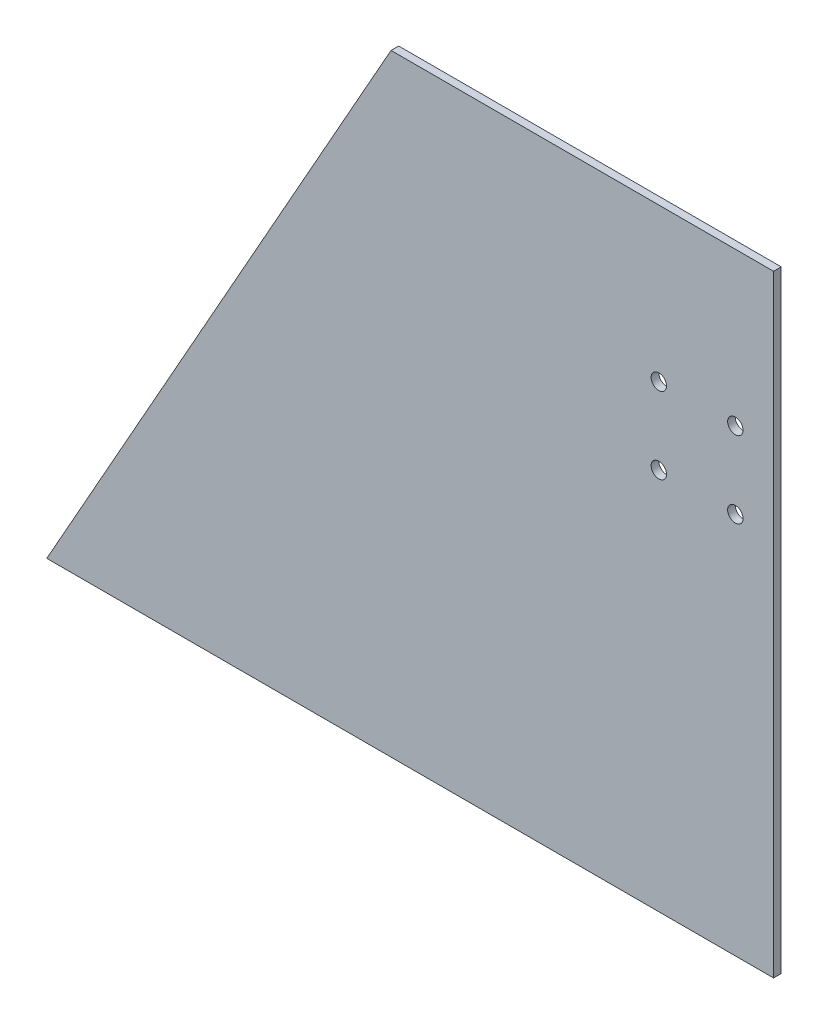
ISO-10303-21;
HEADER;
FILE_DESCRIPTION(('STEP AP214'),'2;1');
FILE_NAME('part.step','',(''),(''),'','','');
FILE_SCHEMA(('AUTOMOTIVE_DESIGN { 1 0 10303 214 1 1 1 1 }'));
ENDSEC;
DATA;
#1=APPLICATION_CONTEXT('core data for automotive mechanical design processes');
#2=APPLICATION_PROTOCOL_DEFINITION('international standard','automotive_design',2000,#1);
#3=PRODUCT_CONTEXT('',#1,'mechanical');
#4=PRODUCT('Part','Part','',(#3));
#5=PRODUCT_RELATED_PRODUCT_CATEGORY('part','',(#4));
#6=PRODUCT_DEFINITION_FORMATION('','',#4);
#7=PRODUCT_DEFINITION_CONTEXT('part definition',#1,'design');
#8=PRODUCT_DEFINITION('design','',#6,#7);
#9=PRODUCT_DEFINITION_SHAPE('','',#8);
#10=(LENGTH_UNIT() NAMED_UNIT(*) SI_UNIT(.MILLI.,.METRE.));
#11=(NAMED_UNIT(*) PLANE_ANGLE_UNIT() SI_UNIT($,.RADIAN.));
#12=(NAMED_UNIT(*) SI_UNIT($,.STERADIAN.) SOLID_ANGLE_UNIT());
#13=UNCERTAINTY_MEASURE_WITH_UNIT(LENGTH_MEASURE(1.E-05),#10,'distance_accuracy_value','');
#14=(GEOMETRIC_REPRESENTATION_CONTEXT(3) GLOBAL_UNCERTAINTY_ASSIGNED_CONTEXT((#13)) GLOBAL_UNIT_ASSIGNED_CONTEXT((#10,
#11,#12)) REPRESENTATION_CONTEXT('',''));
#15=CARTESIAN_POINT('',(0.,0.,0.));
#16=DIRECTION('',(0.,0.,1.));
#17=DIRECTION('',(1.,0.,0.));
#18=AXIS2_PLACEMENT_3D('',#15,#16,#17);
#19=CARTESIAN_POINT('',(114.3,203.2,2.54));
#20=DIRECTION('',(0.871575537124549,-0.490261239632559,0.));
#21=DIRECTION('',(0.490261239632559,0.871575537124549,0.));
#22=AXIS2_PLACEMENT_3D('',#19,#20,#21);
#23=PLANE('',#22);
#24=DIRECTION('',(-0.490261239632559,-0.871575537124549,0.));
#25=VECTOR('',#24,1.);
#26=CARTESIAN_POINT('',(114.3,203.2,0.));
#27=LINE('',#26,#25);
#28=CARTESIAN_POINT('',(114.3,203.2,0.));
#29=VERTEX_POINT('',#28);
#30=CARTESIAN_POINT('',(0.,0.,0.));
#31=VERTEX_POINT('',#30);
#32=EDGE_CURVE('E98',#29,#31,#27,.T.);
#33=ORIENTED_EDGE('',*,*,#32,.T.);
#34=DIRECTION('',(0.,0.,-1.));
#35=VECTOR('',#34,1.);
#36=CARTESIAN_POINT('',(0.,0.,2.54));
#37=LINE('',#36,#35);
#38=CARTESIAN_POINT('',(0.,0.,2.54));
#39=VERTEX_POINT('',#38);
#40=EDGE_CURVE('E11',#39,#31,#37,.T.);
#41=ORIENTED_EDGE('',*,*,#40,.F.);
#42=DIRECTION('',(-0.490261239632559,-0.871575537124549,0.));
#43=VECTOR('',#42,1.);
#44=CARTESIAN_POINT('',(114.3,203.2,2.54));
#45=LINE('',#44,#43);
#46=CARTESIAN_POINT('',(114.3,203.2,2.54));
#47=VERTEX_POINT('',#46);
#48=EDGE_CURVE('E86',#47,#39,#45,.T.);
#49=ORIENTED_EDGE('',*,*,#48,.F.);
#50=DIRECTION('',(0.,0.,-1.));
#51=VECTOR('',#50,1.);
#52=CARTESIAN_POINT('',(114.3,203.2,2.54));
#53=LINE('',#52,#51);
#54=EDGE_CURVE('E94',#47,#29,#53,.T.);
#55=ORIENTED_EDGE('',*,*,#54,.T.);
#56=EDGE_LOOP('',(#33,#41,#49,#55));
#57=FACE_BOUND('',#56,.T.);
#58=ADVANCED_FACE('F35',(#57),#23,.F.);
#59=CARTESIAN_POINT('',(0.,0.,2.54));
#60=DIRECTION('',(0.,1.,0.));
#61=DIRECTION('',(0.,0.,1.));
#62=AXIS2_PLACEMENT_3D('',#59,#60,#61);
#63=PLANE('',#62);
#64=DIRECTION('',(1.,0.,0.));
#65=VECTOR('',#64,1.);
#66=CARTESIAN_POINT('',(0.,0.,0.));
#67=LINE('',#66,#65);
#68=CARTESIAN_POINT('',(241.3,0.,0.));
#69=VERTEX_POINT('',#68);
#70=EDGE_CURVE('E90',#31,#69,#67,.T.);
#71=ORIENTED_EDGE('',*,*,#70,.T.);
#72=DIRECTION('',(0.,0.,-1.));
#73=VECTOR('',#72,1.);
#74=CARTESIAN_POINT('',(241.3,0.,2.54));
#75=LINE('',#74,#73);
#76=CARTESIAN_POINT('',(241.3,0.,2.54));
#77=VERTEX_POINT('',#76);
#78=EDGE_CURVE('E43',#77,#69,#75,.T.);
#79=ORIENTED_EDGE('',*,*,#78,.F.);
#80=DIRECTION('',(1.,0.,0.));
#81=VECTOR('',#80,1.);
#82=CARTESIAN_POINT('',(0.,0.,2.54));
#83=LINE('',#82,#81);
#84=EDGE_CURVE('E81',#39,#77,#83,.T.);
#85=ORIENTED_EDGE('',*,*,#84,.F.);
#86=ORIENTED_EDGE('',*,*,#40,.T.);
#87=EDGE_LOOP('',(#71,#79,#85,#86));
#88=FACE_BOUND('',#87,.T.);
#89=ADVANCED_FACE('F89',(#88),#63,.F.);
#90=CARTESIAN_POINT('',(241.3,0.,2.54));
#91=DIRECTION('',(-1.,0.,0.));
#92=DIRECTION('',(0.,0.,1.));
#93=AXIS2_PLACEMENT_3D('',#90,#91,#92);
#94=PLANE('',#93);
#95=DIRECTION('',(0.,1.,0.));
#96=VECTOR('',#95,1.);
#97=CARTESIAN_POINT('',(241.3,0.,0.));
#98=LINE('',#97,#96);
#99=CARTESIAN_POINT('',(241.3,203.2,0.));
#100=VERTEX_POINT('',#99);
#101=EDGE_CURVE('E68',#69,#100,#98,.T.);
#102=ORIENTED_EDGE('',*,*,#101,.T.);
#103=DIRECTION('',(0.,0.,-1.));
#104=VECTOR('',#103,1.);
#105=CARTESIAN_POINT('',(241.3,203.2,2.54));
#106=LINE('',#105,#104);
#107=CARTESIAN_POINT('',(241.3,203.2,2.54));
#108=VERTEX_POINT('',#107);
#109=EDGE_CURVE('E91',#108,#100,#106,.T.);
#110=ORIENTED_EDGE('',*,*,#109,.F.);
#111=DIRECTION('',(0.,1.,0.));
#112=VECTOR('',#111,1.);
#113=CARTESIAN_POINT('',(241.3,0.,2.54));
#114=LINE('',#113,#112);
#115=EDGE_CURVE('E84',#77,#108,#114,.T.);
#116=ORIENTED_EDGE('',*,*,#115,.F.);
#117=ORIENTED_EDGE('',*,*,#78,.T.);
#118=EDGE_LOOP('',(#102,#110,#116,#117));
#119=FACE_BOUND('',#118,.T.);
#120=ADVANCED_FACE('F92',(#119),#94,.F.);
#121=CARTESIAN_POINT('',(241.3,203.2,2.54));
#122=DIRECTION('',(0.,-1.,0.));
#123=DIRECTION('',(1.,0.,0.));
#124=AXIS2_PLACEMENT_3D('',#121,#122,#123);
#125=PLANE('',#124);
#126=DIRECTION('',(-1.,0.,0.));
#127=VECTOR('',#126,1.);
#128=CARTESIAN_POINT('',(241.3,203.2,0.));
#129=LINE('',#128,#127);
#130=EDGE_CURVE('E74',#100,#29,#129,.T.);
#131=ORIENTED_EDGE('',*,*,#130,.T.);
#132=ORIENTED_EDGE('',*,*,#54,.F.);
#133=DIRECTION('',(-1.,0.,0.));
#134=VECTOR('',#133,1.);
#135=CARTESIAN_POINT('',(241.3,203.2,2.54));
#136=LINE('',#135,#134);
#137=EDGE_CURVE('E51',#108,#47,#136,.T.);
#138=ORIENTED_EDGE('',*,*,#137,.F.);
#139=ORIENTED_EDGE('',*,*,#109,.T.);
#140=EDGE_LOOP('',(#131,#132,#138,#139));
#141=FACE_BOUND('',#140,.T.);
#142=ADVANCED_FACE('F106',(#141),#125,.F.);
#143=CARTESIAN_POINT('',(0.,0.,2.54));
#144=DIRECTION('',(0.,0.,1.));
#145=DIRECTION('',(1.,0.,0.));
#146=AXIS2_PLACEMENT_3D('',#143,#144,#145);
#147=PLANE('',#146);
#148=CARTESIAN_POINT('',(203.2,152.4,2.54));
#149=DIRECTION('',(0.,0.,1.));
#150=DIRECTION('',(1.,0.,0.));
#151=AXIS2_PLACEMENT_3D('',#148,#149,#150);
#152=CIRCLE('',#151,2.55269999999999);
#153=CARTESIAN_POINT('',(205.7527,152.4,2.54));
#154=VERTEX_POINT('',#153);
#155=EDGE_CURVE('E132',#154,#154,#152,.T.);
#156=ORIENTED_EDGE('',*,*,#155,.F.);
#157=EDGE_LOOP('',(#156));
#158=FACE_BOUND('',#157,.T.);
#159=CARTESIAN_POINT('',(228.6,127.,2.54));
#160=DIRECTION('',(0.,0.,1.));
#161=DIRECTION('',(1.,0.,0.));
#162=AXIS2_PLACEMENT_3D('',#159,#160,#161);
#163=CIRCLE('',#162,2.55269999999999);
#164=CARTESIAN_POINT('',(231.1527,127.,2.54));
#165=VERTEX_POINT('',#164);
#166=EDGE_CURVE('E126',#165,#165,#163,.T.);
#167=ORIENTED_EDGE('',*,*,#166,.F.);
#168=EDGE_LOOP('',(#167));
#169=FACE_BOUND('',#168,.T.);
#170=CARTESIAN_POINT('',(203.2,127.,2.54));
#171=DIRECTION('',(0.,0.,1.));
#172=DIRECTION('',(1.,0.,0.));
#173=AXIS2_PLACEMENT_3D('',#170,#171,#172);
#174=CIRCLE('',#173,2.55269999999999);
#175=CARTESIAN_POINT('',(205.7527,127.,2.54));
#176=VERTEX_POINT('',#175);
#177=EDGE_CURVE('E120',#176,#176,#174,.T.);
#178=ORIENTED_EDGE('',*,*,#177,.F.);
#179=EDGE_LOOP('',(#178));
#180=FACE_BOUND('',#179,.T.);
#181=CARTESIAN_POINT('',(228.6,152.4,2.54));
#182=DIRECTION('',(0.,0.,1.));
#183=DIRECTION('',(1.,0.,0.));
#184=AXIS2_PLACEMENT_3D('',#181,#182,#183);
#185=CIRCLE('',#184,2.55269999999999);
#186=CARTESIAN_POINT('',(231.1527,152.4,2.54));
#187=VERTEX_POINT('',#186);
#188=EDGE_CURVE('E114',#187,#187,#185,.T.);
#189=ORIENTED_EDGE('',*,*,#188,.F.);
#190=EDGE_LOOP('',(#189));
#191=FACE_BOUND('',#190,.T.);
#192=ORIENTED_EDGE('',*,*,#48,.T.);
#193=ORIENTED_EDGE('',*,*,#84,.T.);
#194=ORIENTED_EDGE('',*,*,#115,.T.);
#195=ORIENTED_EDGE('',*,*,#137,.T.);
#196=EDGE_LOOP('',(#192,#193,#194,#195));
#197=FACE_BOUND('',#196,.T.);
#198=ADVANCED_FACE('F82',(#158,#169,#180,#191,#197),#147,.T.);
#199=CARTESIAN_POINT('',(0.,0.,0.));
#200=DIRECTION('',(0.,0.,1.));
#201=DIRECTION('',(1.,0.,0.));
#202=AXIS2_PLACEMENT_3D('',#199,#200,#201);
#203=PLANE('',#202);
#204=CARTESIAN_POINT('',(203.2,152.4,0.));
#205=DIRECTION('',(0.,0.,1.));
#206=DIRECTION('',(1.,0.,0.));
#207=AXIS2_PLACEMENT_3D('',#204,#205,#206);
#208=CIRCLE('',#207,2.55269999999999);
#209=CARTESIAN_POINT('',(205.7527,152.4,0.));
#210=VERTEX_POINT('',#209);
#211=EDGE_CURVE('E129',#210,#210,#208,.T.);
#212=ORIENTED_EDGE('',*,*,#211,.T.);
#213=EDGE_LOOP('',(#212));
#214=FACE_BOUND('',#213,.T.);
#215=CARTESIAN_POINT('',(228.6,127.,0.));
#216=DIRECTION('',(0.,0.,1.));
#217=DIRECTION('',(1.,0.,0.));
#218=AXIS2_PLACEMENT_3D('',#215,#216,#217);
#219=CIRCLE('',#218,2.55269999999999);
#220=CARTESIAN_POINT('',(231.1527,127.,0.));
#221=VERTEX_POINT('',#220);
#222=EDGE_CURVE('E123',#221,#221,#219,.T.);
#223=ORIENTED_EDGE('',*,*,#222,.T.);
#224=EDGE_LOOP('',(#223));
#225=FACE_BOUND('',#224,.T.);
#226=CARTESIAN_POINT('',(203.2,127.,0.));
#227=DIRECTION('',(0.,0.,1.));
#228=DIRECTION('',(1.,0.,0.));
#229=AXIS2_PLACEMENT_3D('',#226,#227,#228);
#230=CIRCLE('',#229,2.55269999999999);
#231=CARTESIAN_POINT('',(205.7527,127.,0.));
#232=VERTEX_POINT('',#231);
#233=EDGE_CURVE('E117',#232,#232,#230,.T.);
#234=ORIENTED_EDGE('',*,*,#233,.T.);
#235=EDGE_LOOP('',(#234));
#236=FACE_BOUND('',#235,.T.);
#237=CARTESIAN_POINT('',(228.6,152.4,0.));
#238=DIRECTION('',(0.,0.,1.));
#239=DIRECTION('',(1.,0.,0.));
#240=AXIS2_PLACEMENT_3D('',#237,#238,#239);
#241=CIRCLE('',#240,2.55269999999999);
#242=CARTESIAN_POINT('',(231.1527,152.4,0.));
#243=VERTEX_POINT('',#242);
#244=EDGE_CURVE('E101',#243,#243,#241,.T.);
#245=ORIENTED_EDGE('',*,*,#244,.T.);
#246=EDGE_LOOP('',(#245));
#247=FACE_BOUND('',#246,.T.);
#248=ORIENTED_EDGE('',*,*,#32,.F.);
#249=ORIENTED_EDGE('',*,*,#130,.F.);
#250=ORIENTED_EDGE('',*,*,#101,.F.);
#251=ORIENTED_EDGE('',*,*,#70,.F.);
#252=EDGE_LOOP('',(#248,#249,#250,#251));
#253=FACE_BOUND('',#252,.T.);
#254=ADVANCED_FACE('F109',(#214,#225,#236,#247,#253),#203,.F.);
#255=CARTESIAN_POINT('',(228.6,152.4,2.54));
#256=DIRECTION('',(0.,0.,1.));
#257=DIRECTION('',(1.,0.,0.));
#258=AXIS2_PLACEMENT_3D('',#255,#256,#257);
#259=CYLINDRICAL_SURFACE('',#258,2.55269999999999);
#260=ORIENTED_EDGE('',*,*,#244,.F.);
#261=EDGE_LOOP('',(#260));
#262=FACE_BOUND('',#261,.T.);
#263=ORIENTED_EDGE('',*,*,#188,.T.);
#264=EDGE_LOOP('',(#263));
#265=FACE_BOUND('',#264,.T.);
#266=ADVANCED_FACE('F147',(#262,#265),#259,.F.);
#267=CARTESIAN_POINT('',(203.2,127.,2.54));
#268=DIRECTION('',(0.,0.,1.));
#269=DIRECTION('',(1.,0.,0.));
#270=AXIS2_PLACEMENT_3D('',#267,#268,#269);
#271=CYLINDRICAL_SURFACE('',#270,2.55269999999999);
#272=ORIENTED_EDGE('',*,*,#233,.F.);
#273=EDGE_LOOP('',(#272));
#274=FACE_BOUND('',#273,.T.);
#275=ORIENTED_EDGE('',*,*,#177,.T.);
#276=EDGE_LOOP('',(#275));
#277=FACE_BOUND('',#276,.T.);
#278=ADVANCED_FACE('F149',(#274,#277),#271,.F.);
#279=CARTESIAN_POINT('',(228.6,127.,2.54));
#280=DIRECTION('',(0.,0.,1.));
#281=DIRECTION('',(1.,0.,0.));
#282=AXIS2_PLACEMENT_3D('',#279,#280,#281);
#283=CYLINDRICAL_SURFACE('',#282,2.55269999999999);
#284=ORIENTED_EDGE('',*,*,#222,.F.);
#285=EDGE_LOOP('',(#284));
#286=FACE_BOUND('',#285,.T.);
#287=ORIENTED_EDGE('',*,*,#166,.T.);
#288=EDGE_LOOP('',(#287));
#289=FACE_BOUND('',#288,.T.);
#290=ADVANCED_FACE('F156',(#286,#289),#283,.F.);
#291=CARTESIAN_POINT('',(203.2,152.4,2.54));
#292=DIRECTION('',(0.,0.,1.));
#293=DIRECTION('',(1.,0.,0.));
#294=AXIS2_PLACEMENT_3D('',#291,#292,#293);
#295=CYLINDRICAL_SURFACE('',#294,2.55269999999999);
#296=ORIENTED_EDGE('',*,*,#211,.F.);
#297=EDGE_LOOP('',(#296));
#298=FACE_BOUND('',#297,.T.);
#299=ORIENTED_EDGE('',*,*,#155,.T.);
#300=EDGE_LOOP('',(#299));
#301=FACE_BOUND('',#300,.T.);
#302=ADVANCED_FACE('F136',(#298,#301),#295,.F.);
#303=CLOSED_SHELL('',(#58,#89,#120,#142,#198,#254,#266,#278,#290,#302));
#304=MANIFOLD_SOLID_BREP('B2',#303);
#305=ADVANCED_BREP_SHAPE_REPRESENTATION('',(#18,#304),#14);
#306=SHAPE_DEFINITION_REPRESENTATION(#9,#305);
ENDSEC;
END-ISO-10303-21;
